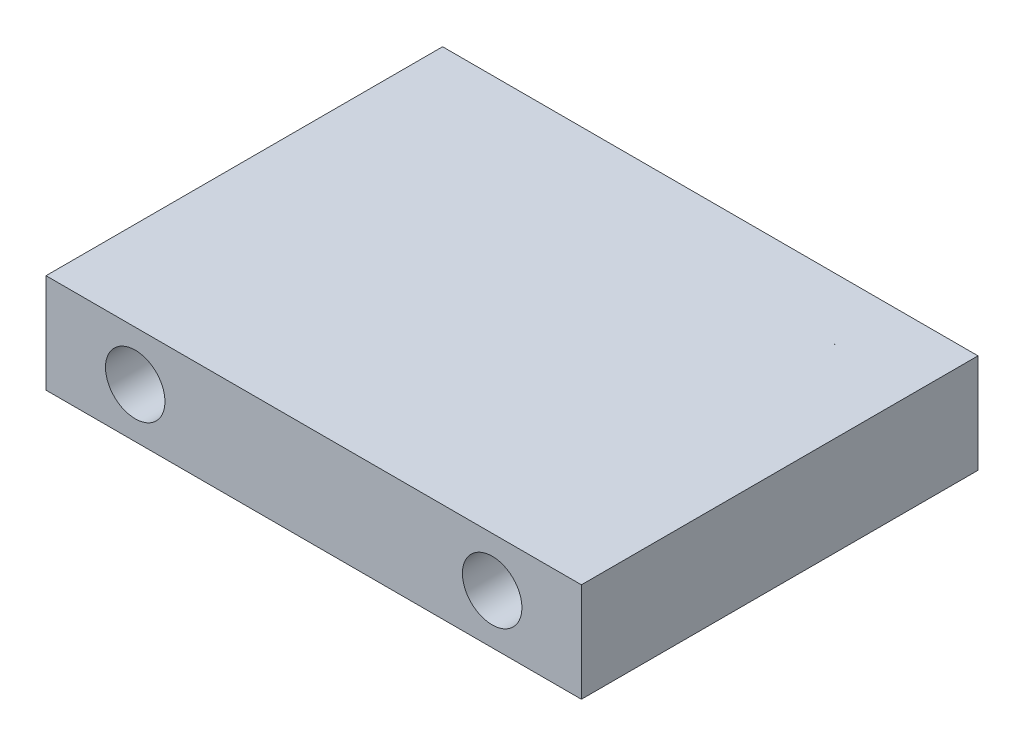
ISO-10303-21;
HEADER;
FILE_DESCRIPTION(('STEP AP214'),'2;1');
FILE_NAME('part.step','',(''),(''),'','','');
FILE_SCHEMA(('AUTOMOTIVE_DESIGN { 1 0 10303 214 1 1 1 1 }'));
ENDSEC;
DATA;
#1=APPLICATION_CONTEXT('core data for automotive mechanical design processes');
#2=APPLICATION_PROTOCOL_DEFINITION('international standard','automotive_design',2000,#1);
#3=PRODUCT_CONTEXT('',#1,'mechanical');
#4=PRODUCT('Part','Part','',(#3));
#5=PRODUCT_RELATED_PRODUCT_CATEGORY('part','',(#4));
#6=PRODUCT_DEFINITION_FORMATION('','',#4);
#7=PRODUCT_DEFINITION_CONTEXT('part definition',#1,'design');
#8=PRODUCT_DEFINITION('design','',#6,#7);
#9=PRODUCT_DEFINITION_SHAPE('','',#8);
#10=(LENGTH_UNIT() NAMED_UNIT(*) SI_UNIT(.MILLI.,.METRE.));
#11=(NAMED_UNIT(*) PLANE_ANGLE_UNIT() SI_UNIT($,.RADIAN.));
#12=(NAMED_UNIT(*) SI_UNIT($,.STERADIAN.) SOLID_ANGLE_UNIT());
#13=UNCERTAINTY_MEASURE_WITH_UNIT(LENGTH_MEASURE(1.E-05),#10,'distance_accuracy_value','');
#14=(GEOMETRIC_REPRESENTATION_CONTEXT(3) GLOBAL_UNCERTAINTY_ASSIGNED_CONTEXT((#13)) GLOBAL_UNIT_ASSIGNED_CONTEXT((#10,
#11,#12)) REPRESENTATION_CONTEXT('',''));
#15=CARTESIAN_POINT('',(0.,0.,0.));
#16=DIRECTION('',(0.,0.,1.));
#17=DIRECTION('',(1.,0.,0.));
#18=AXIS2_PLACEMENT_3D('',#15,#16,#17);
#19=CARTESIAN_POINT('',(0.,5.,0.));
#20=DIRECTION('',(0.,0.,-1.));
#21=DIRECTION('',(-1.,0.,0.));
#22=AXIS2_PLACEMENT_3D('',#19,#20,#21);
#23=PLANE('',#22);
#24=CARTESIAN_POINT('',(4.5,2.5,0.));
#25=DIRECTION('',(0.,0.,-1.));
#26=DIRECTION('',(-1.,0.,0.));
#27=AXIS2_PLACEMENT_3D('',#24,#25,#26);
#28=CIRCLE('',#27,1.5);
#29=CARTESIAN_POINT('',(3.,2.5,0.));
#30=VERTEX_POINT('',#29);
#31=EDGE_CURVE('E103',#30,#30,#28,.F.);
#32=ORIENTED_EDGE('',*,*,#31,.F.);
#33=EDGE_LOOP('',(#32));
#34=FACE_BOUND('',#33,.T.);
#35=DIRECTION('',(1.,0.,0.));
#36=VECTOR('',#35,1.);
#37=CARTESIAN_POINT('',(0.,0.,0.));
#38=LINE('',#37,#36);
#39=CARTESIAN_POINT('',(0.,0.,0.));
#40=VERTEX_POINT('',#39);
#41=CARTESIAN_POINT('',(27.,0.,0.));
#42=VERTEX_POINT('',#41);
#43=EDGE_CURVE('E91',#40,#42,#38,.T.);
#44=ORIENTED_EDGE('',*,*,#43,.T.);
#45=DIRECTION('',(0.,-1.,0.));
#46=VECTOR('',#45,1.);
#47=CARTESIAN_POINT('',(27.,5.,0.));
#48=LINE('',#47,#46);
#49=CARTESIAN_POINT('',(27.,5.,0.));
#50=VERTEX_POINT('',#49);
#51=EDGE_CURVE('E43',#50,#42,#48,.T.);
#52=ORIENTED_EDGE('',*,*,#51,.F.);
#53=DIRECTION('',(1.,0.,0.));
#54=VECTOR('',#53,1.);
#55=CARTESIAN_POINT('',(0.,5.,0.));
#56=LINE('',#55,#54);
#57=CARTESIAN_POINT('',(0.,5.,0.));
#58=VERTEX_POINT('',#57);
#59=EDGE_CURVE('E82',#58,#50,#56,.T.);
#60=ORIENTED_EDGE('',*,*,#59,.F.);
#61=DIRECTION('',(0.,-1.,0.));
#62=VECTOR('',#61,1.);
#63=CARTESIAN_POINT('',(0.,5.,0.));
#64=LINE('',#63,#62);
#65=EDGE_CURVE('E11',#58,#40,#64,.T.);
#66=ORIENTED_EDGE('',*,*,#65,.T.);
#67=EDGE_LOOP('',(#44,#52,#60,#66));
#68=FACE_BOUND('',#67,.T.);
#69=CARTESIAN_POINT('',(22.5,2.5,0.));
#70=DIRECTION('',(0.,0.,-1.));
#71=DIRECTION('',(-1.,0.,0.));
#72=AXIS2_PLACEMENT_3D('',#69,#70,#71);
#73=CIRCLE('',#72,1.5);
#74=CARTESIAN_POINT('',(21.,2.5,0.));
#75=VERTEX_POINT('',#74);
#76=EDGE_CURVE('E110',#75,#75,#73,.F.);
#77=ORIENTED_EDGE('',*,*,#76,.F.);
#78=EDGE_LOOP('',(#77));
#79=FACE_BOUND('',#78,.T.);
#80=ADVANCED_FACE('F33',(#34,#68,#79),#23,.F.);
#81=CARTESIAN_POINT('',(0.,5.,-20.));
#82=DIRECTION('',(0.,0.,1.));
#83=DIRECTION('',(1.,0.,0.));
#84=AXIS2_PLACEMENT_3D('',#81,#82,#83);
#85=PLANE('',#84);
#86=CARTESIAN_POINT('',(4.5,2.5,-20.));
#87=DIRECTION('',(0.,0.,1.));
#88=DIRECTION('',(1.,0.,0.));
#89=AXIS2_PLACEMENT_3D('',#86,#87,#88);
#90=CIRCLE('',#89,1.5);
#91=CARTESIAN_POINT('',(6.,2.5,-20.));
#92=VERTEX_POINT('',#91);
#93=EDGE_CURVE('E108',#92,#92,#90,.F.);
#94=ORIENTED_EDGE('',*,*,#93,.F.);
#95=EDGE_LOOP('',(#94));
#96=FACE_BOUND('',#95,.T.);
#97=DIRECTION('',(-1.,0.,0.));
#98=VECTOR('',#97,1.);
#99=CARTESIAN_POINT('',(0.,0.,-20.));
#100=LINE('',#99,#98);
#101=CARTESIAN_POINT('',(27.,0.,-20.));
#102=VERTEX_POINT('',#101);
#103=CARTESIAN_POINT('',(0.,0.,-20.));
#104=VERTEX_POINT('',#103);
#105=EDGE_CURVE('E75',#102,#104,#100,.T.);
#106=ORIENTED_EDGE('',*,*,#105,.T.);
#107=DIRECTION('',(0.,-1.,0.));
#108=VECTOR('',#107,1.);
#109=CARTESIAN_POINT('',(0.,5.,-20.));
#110=LINE('',#109,#108);
#111=CARTESIAN_POINT('',(0.,5.,-20.));
#112=VERTEX_POINT('',#111);
#113=EDGE_CURVE('E96',#112,#104,#110,.T.);
#114=ORIENTED_EDGE('',*,*,#113,.F.);
#115=DIRECTION('',(-1.,0.,0.));
#116=VECTOR('',#115,1.);
#117=CARTESIAN_POINT('',(0.,5.,-20.));
#118=LINE('',#117,#116);
#119=CARTESIAN_POINT('',(27.,5.,-20.));
#120=VERTEX_POINT('',#119);
#121=EDGE_CURVE('E52',#120,#112,#118,.T.);
#122=ORIENTED_EDGE('',*,*,#121,.F.);
#123=DIRECTION('',(0.,-1.,0.));
#124=VECTOR('',#123,1.);
#125=CARTESIAN_POINT('',(27.,5.,-20.));
#126=LINE('',#125,#124);
#127=EDGE_CURVE('E92',#120,#102,#126,.T.);
#128=ORIENTED_EDGE('',*,*,#127,.T.);
#129=EDGE_LOOP('',(#106,#114,#122,#128));
#130=FACE_BOUND('',#129,.T.);
#131=CARTESIAN_POINT('',(22.5,2.5,-20.));
#132=DIRECTION('',(0.,0.,1.));
#133=DIRECTION('',(1.,0.,0.));
#134=AXIS2_PLACEMENT_3D('',#131,#132,#133);
#135=CIRCLE('',#134,1.5);
#136=CARTESIAN_POINT('',(24.,2.5,-20.));
#137=VERTEX_POINT('',#136);
#138=EDGE_CURVE('E37',#137,#137,#135,.F.);
#139=ORIENTED_EDGE('',*,*,#138,.F.);
#140=EDGE_LOOP('',(#139));
#141=FACE_BOUND('',#140,.T.);
#142=ADVANCED_FACE('F124',(#96,#130,#141),#85,.F.);
#143=CARTESIAN_POINT('',(0.,5.,0.));
#144=DIRECTION('',(1.,0.,0.));
#145=DIRECTION('',(0.,0.,-1.));
#146=AXIS2_PLACEMENT_3D('',#143,#144,#145);
#147=PLANE('',#146);
#148=DIRECTION('',(0.,0.,1.));
#149=VECTOR('',#148,1.);
#150=CARTESIAN_POINT('',(0.,0.,0.));
#151=LINE('',#150,#149);
#152=EDGE_CURVE('E100',#104,#40,#151,.T.);
#153=ORIENTED_EDGE('',*,*,#152,.T.);
#154=ORIENTED_EDGE('',*,*,#65,.F.);
#155=DIRECTION('',(0.,0.,1.));
#156=VECTOR('',#155,1.);
#157=CARTESIAN_POINT('',(0.,5.,0.));
#158=LINE('',#157,#156);
#159=EDGE_CURVE('E87',#112,#58,#158,.T.);
#160=ORIENTED_EDGE('',*,*,#159,.F.);
#161=ORIENTED_EDGE('',*,*,#113,.T.);
#162=EDGE_LOOP('',(#153,#154,#160,#161));
#163=FACE_BOUND('',#162,.T.);
#164=ADVANCED_FACE('F35',(#163),#147,.F.);
#165=CARTESIAN_POINT('',(27.,5.,0.));
#166=DIRECTION('',(-1.,0.,0.));
#167=DIRECTION('',(0.,0.,1.));
#168=AXIS2_PLACEMENT_3D('',#165,#166,#167);
#169=PLANE('',#168);
#170=DIRECTION('',(0.,0.,-1.));
#171=VECTOR('',#170,1.);
#172=CARTESIAN_POINT('',(27.,0.,0.));
#173=LINE('',#172,#171);
#174=EDGE_CURVE('E69',#42,#102,#173,.T.);
#175=ORIENTED_EDGE('',*,*,#174,.T.);
#176=ORIENTED_EDGE('',*,*,#127,.F.);
#177=DIRECTION('',(0.,0.,-1.));
#178=VECTOR('',#177,1.);
#179=CARTESIAN_POINT('',(27.,5.,0.));
#180=LINE('',#179,#178);
#181=EDGE_CURVE('E85',#50,#120,#180,.T.);
#182=ORIENTED_EDGE('',*,*,#181,.F.);
#183=ORIENTED_EDGE('',*,*,#51,.T.);
#184=EDGE_LOOP('',(#175,#176,#182,#183));
#185=FACE_BOUND('',#184,.T.);
#186=ADVANCED_FACE('F94',(#185),#169,.F.);
#187=CARTESIAN_POINT('',(0.,5.,0.));
#188=DIRECTION('',(0.,-1.,0.));
#189=DIRECTION('',(0.,0.,-1.));
#190=AXIS2_PLACEMENT_3D('',#187,#188,#189);
#191=PLANE('',#190);
#192=ORIENTED_EDGE('',*,*,#159,.T.);
#193=ORIENTED_EDGE('',*,*,#59,.T.);
#194=ORIENTED_EDGE('',*,*,#181,.T.);
#195=ORIENTED_EDGE('',*,*,#121,.T.);
#196=EDGE_LOOP('',(#192,#193,#194,#195));
#197=FACE_BOUND('',#196,.T.);
#198=ADVANCED_FACE('F83',(#197),#191,.F.);
#199=CARTESIAN_POINT('',(0.,0.,0.));
#200=DIRECTION('',(0.,-1.,0.));
#201=DIRECTION('',(0.,0.,-1.));
#202=AXIS2_PLACEMENT_3D('',#199,#200,#201);
#203=PLANE('',#202);
#204=ORIENTED_EDGE('',*,*,#152,.F.);
#205=ORIENTED_EDGE('',*,*,#105,.F.);
#206=ORIENTED_EDGE('',*,*,#174,.F.);
#207=ORIENTED_EDGE('',*,*,#43,.F.);
#208=EDGE_LOOP('',(#204,#205,#206,#207));
#209=FACE_BOUND('',#208,.T.);
#210=ADVANCED_FACE('F136',(#209),#203,.T.);
#211=CARTESIAN_POINT('',(4.5,2.5,1000.));
#212=DIRECTION('',(0.,0.,-1.));
#213=DIRECTION('',(-1.,0.,0.));
#214=AXIS2_PLACEMENT_3D('',#211,#212,#213);
#215=CYLINDRICAL_SURFACE('',#214,1.5);
#216=ORIENTED_EDGE('',*,*,#93,.T.);
#217=EDGE_LOOP('',(#216));
#218=FACE_BOUND('',#217,.T.);
#219=ORIENTED_EDGE('',*,*,#31,.T.);
#220=EDGE_LOOP('',(#219));
#221=FACE_BOUND('',#220,.T.);
#222=ADVANCED_FACE('F145',(#218,#221),#215,.F.);
#223=CARTESIAN_POINT('',(22.5,2.5,1000.));
#224=DIRECTION('',(0.,0.,-1.));
#225=DIRECTION('',(-1.,0.,0.));
#226=AXIS2_PLACEMENT_3D('',#223,#224,#225);
#227=CYLINDRICAL_SURFACE('',#226,1.5);
#228=ORIENTED_EDGE('',*,*,#138,.T.);
#229=EDGE_LOOP('',(#228));
#230=FACE_BOUND('',#229,.T.);
#231=ORIENTED_EDGE('',*,*,#76,.T.);
#232=EDGE_LOOP('',(#231));
#233=FACE_BOUND('',#232,.T.);
#234=ADVANCED_FACE('F122',(#230,#233),#227,.F.);
#235=CLOSED_SHELL('',(#80,#142,#164,#186,#198,#210,#222,#234));
#236=MANIFOLD_SOLID_BREP('B2',#235);
#237=ADVANCED_BREP_SHAPE_REPRESENTATION('',(#18,#236),#14);
#238=SHAPE_DEFINITION_REPRESENTATION(#9,#237);
ENDSEC;
END-ISO-10303-21;
